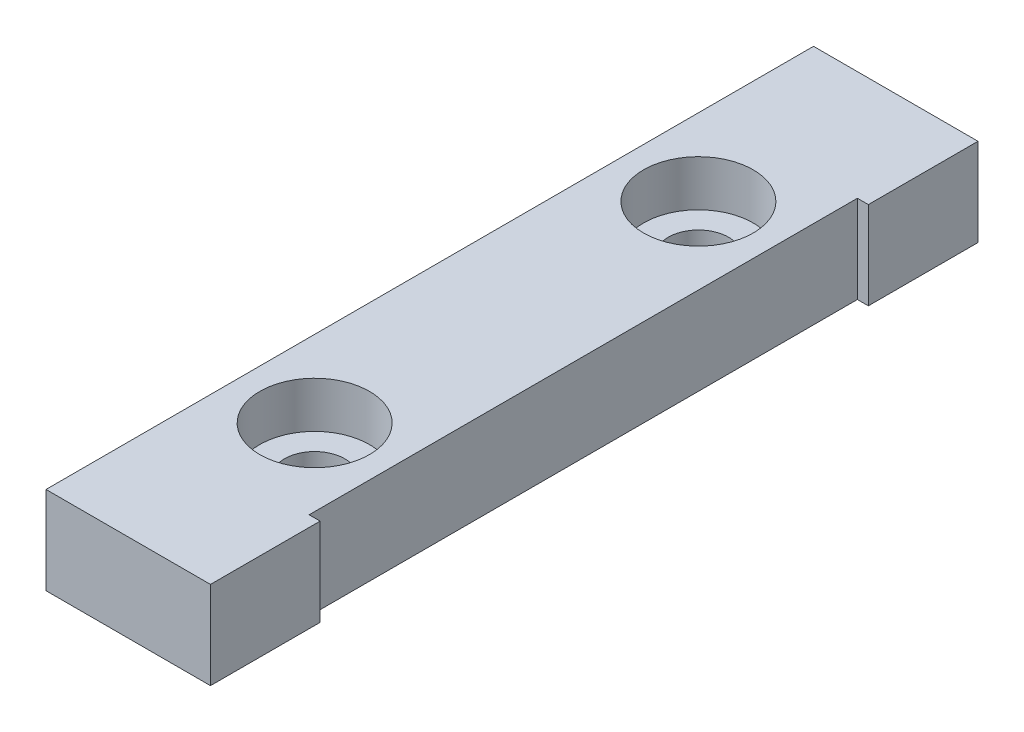
ISO-10303-21;
HEADER;
FILE_DESCRIPTION(('STEP AP214'),'2;1');
FILE_NAME('part.step','',(''),(''),'','','');
FILE_SCHEMA(('AUTOMOTIVE_DESIGN { 1 0 10303 214 1 1 1 1 }'));
ENDSEC;
DATA;
#1=APPLICATION_CONTEXT('core data for automotive mechanical design processes');
#2=APPLICATION_PROTOCOL_DEFINITION('international standard','automotive_design',2000,#1);
#3=PRODUCT_CONTEXT('',#1,'mechanical');
#4=PRODUCT('Part','Part','',(#3));
#5=PRODUCT_RELATED_PRODUCT_CATEGORY('part','',(#4));
#6=PRODUCT_DEFINITION_FORMATION('','',#4);
#7=PRODUCT_DEFINITION_CONTEXT('part definition',#1,'design');
#8=PRODUCT_DEFINITION('design','',#6,#7);
#9=PRODUCT_DEFINITION_SHAPE('','',#8);
#10=(LENGTH_UNIT() NAMED_UNIT(*) SI_UNIT(.MILLI.,.METRE.));
#11=(NAMED_UNIT(*) PLANE_ANGLE_UNIT() SI_UNIT($,.RADIAN.));
#12=(NAMED_UNIT(*) SI_UNIT($,.STERADIAN.) SOLID_ANGLE_UNIT());
#13=UNCERTAINTY_MEASURE_WITH_UNIT(LENGTH_MEASURE(1.E-05),#10,'distance_accuracy_value','');
#14=(GEOMETRIC_REPRESENTATION_CONTEXT(3) GLOBAL_UNCERTAINTY_ASSIGNED_CONTEXT((#13)) GLOBAL_UNIT_ASSIGNED_CONTEXT((#10,
#11,#12)) REPRESENTATION_CONTEXT('',''));
#15=CARTESIAN_POINT('',(0.,0.,0.));
#16=DIRECTION('',(0.,0.,1.));
#17=DIRECTION('',(1.,0.,0.));
#18=AXIS2_PLACEMENT_3D('',#15,#16,#17);
#19=CARTESIAN_POINT('',(-0.499999999999999,0.,-17.5));
#20=DIRECTION('',(0.,1.,0.));
#21=DIRECTION('',(0.,0.,1.));
#22=AXIS2_PLACEMENT_3D('',#19,#20,#21);
#23=CYLINDRICAL_SURFACE('',#22,2.75);
#24=CARTESIAN_POINT('',(-0.499999999999999,0.,-17.5));
#25=DIRECTION('',(0.,1.,0.));
#26=DIRECTION('',(0.,0.,1.));
#27=AXIS2_PLACEMENT_3D('',#24,#25,#26);
#28=CIRCLE('',#27,2.75);
#29=CARTESIAN_POINT('',(-0.499999999999999,0.,-14.75));
#30=VERTEX_POINT('',#29);
#31=EDGE_CURVE('E192',#30,#30,#28,.T.);
#32=ORIENTED_EDGE('',*,*,#31,.F.);
#33=EDGE_LOOP('',(#32));
#34=FACE_BOUND('',#33,.T.);
#35=CARTESIAN_POINT('',(-0.499999999999999,3.8,-17.5));
#36=DIRECTION('',(0.,1.,0.));
#37=DIRECTION('',(0.,0.,1.));
#38=AXIS2_PLACEMENT_3D('',#35,#36,#37);
#39=CIRCLE('',#38,2.75);
#40=CARTESIAN_POINT('',(-0.499999999999999,3.8,-14.75));
#41=VERTEX_POINT('',#40);
#42=EDGE_CURVE('E43',#41,#41,#39,.F.);
#43=ORIENTED_EDGE('',*,*,#42,.F.);
#44=EDGE_LOOP('',(#43));
#45=FACE_BOUND('',#44,.T.);
#46=ADVANCED_FACE('F39',(#34,#45),#23,.F.);
#47=CARTESIAN_POINT('',(-0.499999999999999,0.,17.5));
#48=DIRECTION('',(0.,1.,0.));
#49=DIRECTION('',(0.,0.,1.));
#50=AXIS2_PLACEMENT_3D('',#47,#48,#49);
#51=CYLINDRICAL_SURFACE('',#50,2.75);
#52=CARTESIAN_POINT('',(-0.499999999999999,0.,17.5));
#53=DIRECTION('',(0.,1.,0.));
#54=DIRECTION('',(0.,0.,1.));
#55=AXIS2_PLACEMENT_3D('',#52,#53,#54);
#56=CIRCLE('',#55,2.75);
#57=CARTESIAN_POINT('',(-0.499999999999999,0.,20.25));
#58=VERTEX_POINT('',#57);
#59=EDGE_CURVE('E148',#58,#58,#56,.T.);
#60=ORIENTED_EDGE('',*,*,#59,.F.);
#61=EDGE_LOOP('',(#60));
#62=FACE_BOUND('',#61,.T.);
#63=CARTESIAN_POINT('',(-0.499999999999999,3.8,17.5));
#64=DIRECTION('',(0.,1.,0.));
#65=DIRECTION('',(0.,0.,1.));
#66=AXIS2_PLACEMENT_3D('',#63,#64,#65);
#67=CIRCLE('',#66,2.75);
#68=CARTESIAN_POINT('',(-0.499999999999999,3.8,20.25));
#69=VERTEX_POINT('',#68);
#70=EDGE_CURVE('E183',#69,#69,#67,.F.);
#71=ORIENTED_EDGE('',*,*,#70,.F.);
#72=EDGE_LOOP('',(#71));
#73=FACE_BOUND('',#72,.T.);
#74=ADVANCED_FACE('F255',(#62,#73),#51,.F.);
#75=CARTESIAN_POINT('',(7.5,8.,-25.));
#76=DIRECTION('',(-1.,0.,0.));
#77=DIRECTION('',(0.,0.,1.));
#78=AXIS2_PLACEMENT_3D('',#75,#76,#77);
#79=PLANE('',#78);
#80=DIRECTION('',(0.,0.,-1.));
#81=VECTOR('',#80,1.);
#82=CARTESIAN_POINT('',(7.5,0.,-25.));
#83=LINE('',#82,#81);
#84=CARTESIAN_POINT('',(7.5,0.,-25.));
#85=VERTEX_POINT('',#84);
#86=CARTESIAN_POINT('',(7.5,0.,-35.));
#87=VERTEX_POINT('',#86);
#88=EDGE_CURVE('E143',#85,#87,#83,.T.);
#89=ORIENTED_EDGE('',*,*,#88,.T.);
#90=DIRECTION('',(0.,-1.,0.));
#91=VECTOR('',#90,1.);
#92=CARTESIAN_POINT('',(7.5,8.,-35.));
#93=LINE('',#92,#91);
#94=CARTESIAN_POINT('',(7.5,8.,-35.));
#95=VERTEX_POINT('',#94);
#96=EDGE_CURVE('E11',#95,#87,#93,.T.);
#97=ORIENTED_EDGE('',*,*,#96,.F.);
#98=DIRECTION('',(0.,0.,-1.));
#99=VECTOR('',#98,1.);
#100=CARTESIAN_POINT('',(7.5,8.,-25.));
#101=LINE('',#100,#99);
#102=CARTESIAN_POINT('',(7.5,8.,-25.));
#103=VERTEX_POINT('',#102);
#104=EDGE_CURVE('E166',#103,#95,#101,.T.);
#105=ORIENTED_EDGE('',*,*,#104,.F.);
#106=DIRECTION('',(0.,-1.,0.));
#107=VECTOR('',#106,1.);
#108=CARTESIAN_POINT('',(7.5,8.,-25.));
#109=LINE('',#108,#107);
#110=EDGE_CURVE('E139',#103,#85,#109,.T.);
#111=ORIENTED_EDGE('',*,*,#110,.T.);
#112=EDGE_LOOP('',(#89,#97,#105,#111));
#113=FACE_BOUND('',#112,.T.);
#114=ADVANCED_FACE('F41',(#113),#79,.F.);
#115=CARTESIAN_POINT('',(-7.5,8.,-35.));
#116=DIRECTION('',(0.,0.,1.));
#117=DIRECTION('',(1.,0.,0.));
#118=AXIS2_PLACEMENT_3D('',#115,#116,#117);
#119=PLANE('',#118);
#120=DIRECTION('',(-1.,0.,0.));
#121=VECTOR('',#120,1.);
#122=CARTESIAN_POINT('',(-7.5,0.,-35.));
#123=LINE('',#122,#121);
#124=CARTESIAN_POINT('',(-7.5,0.,-35.));
#125=VERTEX_POINT('',#124);
#126=EDGE_CURVE('E147',#87,#125,#123,.T.);
#127=ORIENTED_EDGE('',*,*,#126,.T.);
#128=DIRECTION('',(0.,-1.,0.));
#129=VECTOR('',#128,1.);
#130=CARTESIAN_POINT('',(-7.5,8.,-35.));
#131=LINE('',#130,#129);
#132=CARTESIAN_POINT('',(-7.5,8.,-35.));
#133=VERTEX_POINT('',#132);
#134=EDGE_CURVE('E50',#133,#125,#131,.T.);
#135=ORIENTED_EDGE('',*,*,#134,.F.);
#136=DIRECTION('',(-1.,0.,0.));
#137=VECTOR('',#136,1.);
#138=CARTESIAN_POINT('',(-7.5,8.,-35.));
#139=LINE('',#138,#137);
#140=EDGE_CURVE('E102',#95,#133,#139,.T.);
#141=ORIENTED_EDGE('',*,*,#140,.F.);
#142=ORIENTED_EDGE('',*,*,#96,.T.);
#143=EDGE_LOOP('',(#127,#135,#141,#142));
#144=FACE_BOUND('',#143,.T.);
#145=ADVANCED_FACE('F368',(#144),#119,.F.);
#146=CARTESIAN_POINT('',(-7.5,8.,35.));
#147=DIRECTION('',(1.,0.,0.));
#148=DIRECTION('',(0.,0.,-1.));
#149=AXIS2_PLACEMENT_3D('',#146,#147,#148);
#150=PLANE('',#149);
#151=DIRECTION('',(0.,0.,1.));
#152=VECTOR('',#151,1.);
#153=CARTESIAN_POINT('',(-7.5,0.,35.));
#154=LINE('',#153,#152);
#155=CARTESIAN_POINT('',(-7.5,0.,35.));
#156=VERTEX_POINT('',#155);
#157=EDGE_CURVE('E151',#125,#156,#154,.T.);
#158=ORIENTED_EDGE('',*,*,#157,.T.);
#159=DIRECTION('',(0.,-1.,0.));
#160=VECTOR('',#159,1.);
#161=CARTESIAN_POINT('',(-7.5,8.,35.));
#162=LINE('',#161,#160);
#163=CARTESIAN_POINT('',(-7.5,8.,35.));
#164=VERTEX_POINT('',#163);
#165=EDGE_CURVE('E177',#164,#156,#162,.T.);
#166=ORIENTED_EDGE('',*,*,#165,.F.);
#167=DIRECTION('',(0.,0.,1.));
#168=VECTOR('',#167,1.);
#169=CARTESIAN_POINT('',(-7.5,8.,35.));
#170=LINE('',#169,#168);
#171=EDGE_CURVE('E220',#133,#164,#170,.T.);
#172=ORIENTED_EDGE('',*,*,#171,.F.);
#173=ORIENTED_EDGE('',*,*,#134,.T.);
#174=EDGE_LOOP('',(#158,#166,#172,#173));
#175=FACE_BOUND('',#174,.T.);
#176=ADVANCED_FACE('F360',(#175),#150,.F.);
#177=CARTESIAN_POINT('',(-7.5,8.,35.));
#178=DIRECTION('',(0.,0.,-1.));
#179=DIRECTION('',(-1.,0.,0.));
#180=AXIS2_PLACEMENT_3D('',#177,#178,#179);
#181=PLANE('',#180);
#182=DIRECTION('',(1.,0.,0.));
#183=VECTOR('',#182,1.);
#184=CARTESIAN_POINT('',(-7.5,0.,35.));
#185=LINE('',#184,#183);
#186=CARTESIAN_POINT('',(7.5,0.,35.));
#187=VERTEX_POINT('',#186);
#188=EDGE_CURVE('E154',#156,#187,#185,.T.);
#189=ORIENTED_EDGE('',*,*,#188,.T.);
#190=DIRECTION('',(0.,-1.,0.));
#191=VECTOR('',#190,1.);
#192=CARTESIAN_POINT('',(7.5,8.,35.));
#193=LINE('',#192,#191);
#194=CARTESIAN_POINT('',(7.5,8.,35.));
#195=VERTEX_POINT('',#194);
#196=EDGE_CURVE('E173',#195,#187,#193,.T.);
#197=ORIENTED_EDGE('',*,*,#196,.F.);
#198=DIRECTION('',(1.,0.,0.));
#199=VECTOR('',#198,1.);
#200=CARTESIAN_POINT('',(-7.5,8.,35.));
#201=LINE('',#200,#199);
#202=EDGE_CURVE('E223',#164,#195,#201,.T.);
#203=ORIENTED_EDGE('',*,*,#202,.F.);
#204=ORIENTED_EDGE('',*,*,#165,.T.);
#205=EDGE_LOOP('',(#189,#197,#203,#204));
#206=FACE_BOUND('',#205,.T.);
#207=ADVANCED_FACE('F231',(#206),#181,.F.);
#208=CARTESIAN_POINT('',(7.5,8.,35.));
#209=DIRECTION('',(-1.,0.,0.));
#210=DIRECTION('',(0.,0.,1.));
#211=AXIS2_PLACEMENT_3D('',#208,#209,#210);
#212=PLANE('',#211);
#213=DIRECTION('',(0.,0.,-1.));
#214=VECTOR('',#213,1.);
#215=CARTESIAN_POINT('',(7.5,0.,35.));
#216=LINE('',#215,#214);
#217=CARTESIAN_POINT('',(7.5,0.,25.));
#218=VERTEX_POINT('',#217);
#219=EDGE_CURVE('E157',#187,#218,#216,.T.);
#220=ORIENTED_EDGE('',*,*,#219,.T.);
#221=DIRECTION('',(0.,-1.,0.));
#222=VECTOR('',#221,1.);
#223=CARTESIAN_POINT('',(7.5,8.,25.));
#224=LINE('',#223,#222);
#225=CARTESIAN_POINT('',(7.5,8.,25.));
#226=VERTEX_POINT('',#225);
#227=EDGE_CURVE('E132',#226,#218,#224,.T.);
#228=ORIENTED_EDGE('',*,*,#227,.F.);
#229=DIRECTION('',(0.,0.,-1.));
#230=VECTOR('',#229,1.);
#231=CARTESIAN_POINT('',(7.5,8.,35.));
#232=LINE('',#231,#230);
#233=EDGE_CURVE('E121',#195,#226,#232,.T.);
#234=ORIENTED_EDGE('',*,*,#233,.F.);
#235=ORIENTED_EDGE('',*,*,#196,.T.);
#236=EDGE_LOOP('',(#220,#228,#234,#235));
#237=FACE_BOUND('',#236,.T.);
#238=ADVANCED_FACE('F235',(#237),#212,.F.);
#239=CARTESIAN_POINT('',(6.50000000000001,8.,25.));
#240=DIRECTION('',(0.,0.,1.));
#241=DIRECTION('',(1.,0.,0.));
#242=AXIS2_PLACEMENT_3D('',#239,#240,#241);
#243=PLANE('',#242);
#244=DIRECTION('',(-1.,0.,0.));
#245=VECTOR('',#244,1.);
#246=CARTESIAN_POINT('',(6.50000000000001,0.,25.));
#247=LINE('',#246,#245);
#248=CARTESIAN_POINT('',(6.50000000000001,0.,25.));
#249=VERTEX_POINT('',#248);
#250=EDGE_CURVE('E130',#218,#249,#247,.T.);
#251=ORIENTED_EDGE('',*,*,#250,.T.);
#252=DIRECTION('',(0.,-1.,0.));
#253=VECTOR('',#252,1.);
#254=CARTESIAN_POINT('',(6.50000000000001,8.,25.));
#255=LINE('',#254,#253);
#256=CARTESIAN_POINT('',(6.50000000000001,8.,25.));
#257=VERTEX_POINT('',#256);
#258=EDGE_CURVE('E127',#257,#249,#255,.T.);
#259=ORIENTED_EDGE('',*,*,#258,.F.);
#260=DIRECTION('',(-1.,0.,0.));
#261=VECTOR('',#260,1.);
#262=CARTESIAN_POINT('',(6.50000000000001,8.,25.));
#263=LINE('',#262,#261);
#264=EDGE_CURVE('E115',#226,#257,#263,.T.);
#265=ORIENTED_EDGE('',*,*,#264,.F.);
#266=ORIENTED_EDGE('',*,*,#227,.T.);
#267=EDGE_LOOP('',(#251,#259,#265,#266));
#268=FACE_BOUND('',#267,.T.);
#269=ADVANCED_FACE('F128',(#268),#243,.F.);
#270=CARTESIAN_POINT('',(6.5,8.,-25.));
#271=DIRECTION('',(-1.,0.,0.));
#272=DIRECTION('',(0.,0.,1.));
#273=AXIS2_PLACEMENT_3D('',#270,#271,#272);
#274=PLANE('',#273);
#275=DIRECTION('',(0.,0.,-1.));
#276=VECTOR('',#275,1.);
#277=CARTESIAN_POINT('',(6.5,0.,-25.));
#278=LINE('',#277,#276);
#279=CARTESIAN_POINT('',(6.5,0.,-25.));
#280=VERTEX_POINT('',#279);
#281=EDGE_CURVE('E88',#249,#280,#278,.T.);
#282=ORIENTED_EDGE('',*,*,#281,.T.);
#283=DIRECTION('',(0.,-1.,0.));
#284=VECTOR('',#283,1.);
#285=CARTESIAN_POINT('',(6.5,8.,-25.));
#286=LINE('',#285,#284);
#287=CARTESIAN_POINT('',(6.5,8.,-25.));
#288=VERTEX_POINT('',#287);
#289=EDGE_CURVE('E133',#288,#280,#286,.T.);
#290=ORIENTED_EDGE('',*,*,#289,.F.);
#291=DIRECTION('',(0.,0.,-1.));
#292=VECTOR('',#291,1.);
#293=CARTESIAN_POINT('',(6.5,8.,-25.));
#294=LINE('',#293,#292);
#295=EDGE_CURVE('E119',#257,#288,#294,.T.);
#296=ORIENTED_EDGE('',*,*,#295,.F.);
#297=ORIENTED_EDGE('',*,*,#258,.T.);
#298=EDGE_LOOP('',(#282,#290,#296,#297));
#299=FACE_BOUND('',#298,.T.);
#300=ADVANCED_FACE('F135',(#299),#274,.F.);
#301=CARTESIAN_POINT('',(7.5,8.,-25.));
#302=DIRECTION('',(0.,0.,-1.));
#303=DIRECTION('',(-1.,0.,0.));
#304=AXIS2_PLACEMENT_3D('',#301,#302,#303);
#305=PLANE('',#304);
#306=DIRECTION('',(1.,0.,0.));
#307=VECTOR('',#306,1.);
#308=CARTESIAN_POINT('',(7.5,0.,-25.));
#309=LINE('',#308,#307);
#310=EDGE_CURVE('E94',#280,#85,#309,.T.);
#311=ORIENTED_EDGE('',*,*,#310,.T.);
#312=ORIENTED_EDGE('',*,*,#110,.F.);
#313=DIRECTION('',(1.,0.,0.));
#314=VECTOR('',#313,1.);
#315=CARTESIAN_POINT('',(7.5,8.,-25.));
#316=LINE('',#315,#314);
#317=EDGE_CURVE('E59',#288,#103,#316,.T.);
#318=ORIENTED_EDGE('',*,*,#317,.F.);
#319=ORIENTED_EDGE('',*,*,#289,.T.);
#320=EDGE_LOOP('',(#311,#312,#318,#319));
#321=FACE_BOUND('',#320,.T.);
#322=ADVANCED_FACE('F243',(#321),#305,.F.);
#323=CARTESIAN_POINT('',(0.,8.,0.));
#324=DIRECTION('',(0.,-1.,0.));
#325=DIRECTION('',(0.,0.,-1.));
#326=AXIS2_PLACEMENT_3D('',#323,#324,#325);
#327=PLANE('',#326);
#328=CARTESIAN_POINT('',(-0.499999999999999,8.,-17.5));
#329=DIRECTION('',(0.,1.,0.));
#330=DIRECTION('',(0.,0.,1.));
#331=AXIS2_PLACEMENT_3D('',#328,#329,#330);
#332=CIRCLE('',#331,5.);
#333=CARTESIAN_POINT('',(-0.499999999999999,8.,-12.5));
#334=VERTEX_POINT('',#333);
#335=EDGE_CURVE('E194',#334,#334,#332,.T.);
#336=ORIENTED_EDGE('',*,*,#335,.F.);
#337=EDGE_LOOP('',(#336));
#338=FACE_BOUND('',#337,.T.);
#339=CARTESIAN_POINT('',(-0.499999999999999,8.,17.5));
#340=DIRECTION('',(0.,1.,0.));
#341=DIRECTION('',(0.,0.,1.));
#342=AXIS2_PLACEMENT_3D('',#339,#340,#341);
#343=CIRCLE('',#342,5.);
#344=CARTESIAN_POINT('',(-0.499999999999999,8.,22.5));
#345=VERTEX_POINT('',#344);
#346=EDGE_CURVE('E206',#345,#345,#343,.T.);
#347=ORIENTED_EDGE('',*,*,#346,.F.);
#348=EDGE_LOOP('',(#347));
#349=FACE_BOUND('',#348,.T.);
#350=ORIENTED_EDGE('',*,*,#104,.T.);
#351=ORIENTED_EDGE('',*,*,#140,.T.);
#352=ORIENTED_EDGE('',*,*,#171,.T.);
#353=ORIENTED_EDGE('',*,*,#202,.T.);
#354=ORIENTED_EDGE('',*,*,#233,.T.);
#355=ORIENTED_EDGE('',*,*,#264,.T.);
#356=ORIENTED_EDGE('',*,*,#295,.T.);
#357=ORIENTED_EDGE('',*,*,#317,.T.);
#358=EDGE_LOOP('',(#350,#351,#352,#353,#354,#355,#356,#357));
#359=FACE_BOUND('',#358,.T.);
#360=ADVANCED_FACE('F117',(#338,#349,#359),#327,.F.);
#361=CARTESIAN_POINT('',(0.,0.,0.));
#362=DIRECTION('',(0.,-1.,0.));
#363=DIRECTION('',(0.,0.,-1.));
#364=AXIS2_PLACEMENT_3D('',#361,#362,#363);
#365=PLANE('',#364);
#366=ORIENTED_EDGE('',*,*,#59,.T.);
#367=EDGE_LOOP('',(#366));
#368=FACE_BOUND('',#367,.T.);
#369=ORIENTED_EDGE('',*,*,#31,.T.);
#370=EDGE_LOOP('',(#369));
#371=FACE_BOUND('',#370,.T.);
#372=ORIENTED_EDGE('',*,*,#88,.F.);
#373=ORIENTED_EDGE('',*,*,#310,.F.);
#374=ORIENTED_EDGE('',*,*,#281,.F.);
#375=ORIENTED_EDGE('',*,*,#250,.F.);
#376=ORIENTED_EDGE('',*,*,#219,.F.);
#377=ORIENTED_EDGE('',*,*,#188,.F.);
#378=ORIENTED_EDGE('',*,*,#157,.F.);
#379=ORIENTED_EDGE('',*,*,#126,.F.);
#380=EDGE_LOOP('',(#372,#373,#374,#375,#376,#377,#378,#379));
#381=FACE_BOUND('',#380,.T.);
#382=ADVANCED_FACE('F238',(#368,#371,#381),#365,.T.);
#383=CARTESIAN_POINT('',(-0.499999999999999,3.8,17.5));
#384=DIRECTION('',(0.,1.,0.));
#385=DIRECTION('',(0.,0.,1.));
#386=AXIS2_PLACEMENT_3D('',#383,#384,#385);
#387=PLANE('',#386);
#388=CARTESIAN_POINT('',(-0.499999999999999,3.8,17.5));
#389=DIRECTION('',(0.,1.,0.));
#390=DIRECTION('',(0.,0.,1.));
#391=AXIS2_PLACEMENT_3D('',#388,#389,#390);
#392=CIRCLE('',#391,5.);
#393=CARTESIAN_POINT('',(-0.499999999999999,3.8,22.5));
#394=VERTEX_POINT('',#393);
#395=EDGE_CURVE('E200',#394,#394,#392,.T.);
#396=ORIENTED_EDGE('',*,*,#395,.T.);
#397=EDGE_LOOP('',(#396));
#398=FACE_BOUND('',#397,.T.);
#399=ORIENTED_EDGE('',*,*,#70,.T.);
#400=EDGE_LOOP('',(#399));
#401=FACE_BOUND('',#400,.T.);
#402=ADVANCED_FACE('F267',(#398,#401),#387,.T.);
#403=CARTESIAN_POINT('',(-0.499999999999999,3.8,17.5));
#404=DIRECTION('',(0.,1.,0.));
#405=DIRECTION('',(0.,0.,1.));
#406=AXIS2_PLACEMENT_3D('',#403,#404,#405);
#407=CYLINDRICAL_SURFACE('',#406,5.);
#408=ORIENTED_EDGE('',*,*,#395,.F.);
#409=EDGE_LOOP('',(#408));
#410=FACE_BOUND('',#409,.T.);
#411=ORIENTED_EDGE('',*,*,#346,.T.);
#412=EDGE_LOOP('',(#411));
#413=FACE_BOUND('',#412,.T.);
#414=ADVANCED_FACE('F272',(#410,#413),#407,.F.);
#415=CARTESIAN_POINT('',(-0.499999999999999,3.8,-17.5));
#416=DIRECTION('',(0.,1.,0.));
#417=DIRECTION('',(0.,0.,1.));
#418=AXIS2_PLACEMENT_3D('',#415,#416,#417);
#419=PLANE('',#418);
#420=CARTESIAN_POINT('',(-0.499999999999999,3.8,-17.5));
#421=DIRECTION('',(0.,1.,0.));
#422=DIRECTION('',(0.,0.,1.));
#423=AXIS2_PLACEMENT_3D('',#420,#421,#422);
#424=CIRCLE('',#423,5.);
#425=CARTESIAN_POINT('',(-0.499999999999999,3.8,-12.5));
#426=VERTEX_POINT('',#425);
#427=EDGE_CURVE('E186',#426,#426,#424,.T.);
#428=ORIENTED_EDGE('',*,*,#427,.T.);
#429=EDGE_LOOP('',(#428));
#430=FACE_BOUND('',#429,.T.);
#431=ORIENTED_EDGE('',*,*,#42,.T.);
#432=EDGE_LOOP('',(#431));
#433=FACE_BOUND('',#432,.T.);
#434=ADVANCED_FACE('F281',(#430,#433),#419,.T.);
#435=CARTESIAN_POINT('',(-0.499999999999999,3.8,-17.5));
#436=DIRECTION('',(0.,1.,0.));
#437=DIRECTION('',(0.,0.,1.));
#438=AXIS2_PLACEMENT_3D('',#435,#436,#437);
#439=CYLINDRICAL_SURFACE('',#438,5.);
#440=ORIENTED_EDGE('',*,*,#427,.F.);
#441=EDGE_LOOP('',(#440));
#442=FACE_BOUND('',#441,.T.);
#443=ORIENTED_EDGE('',*,*,#335,.T.);
#444=EDGE_LOOP('',(#443));
#445=FACE_BOUND('',#444,.T.);
#446=ADVANCED_FACE('F284',(#442,#445),#439,.F.);
#447=CLOSED_SHELL('',(#46,#74,#114,#145,#176,#207,#238,#269,#300,#322,#360,#382,#402,#414,#434,#446));
#448=MANIFOLD_SOLID_BREP('B2',#447);
#449=ADVANCED_BREP_SHAPE_REPRESENTATION('',(#18,#448),#14);
#450=SHAPE_DEFINITION_REPRESENTATION(#9,#449);
ENDSEC;
END-ISO-10303-21;
